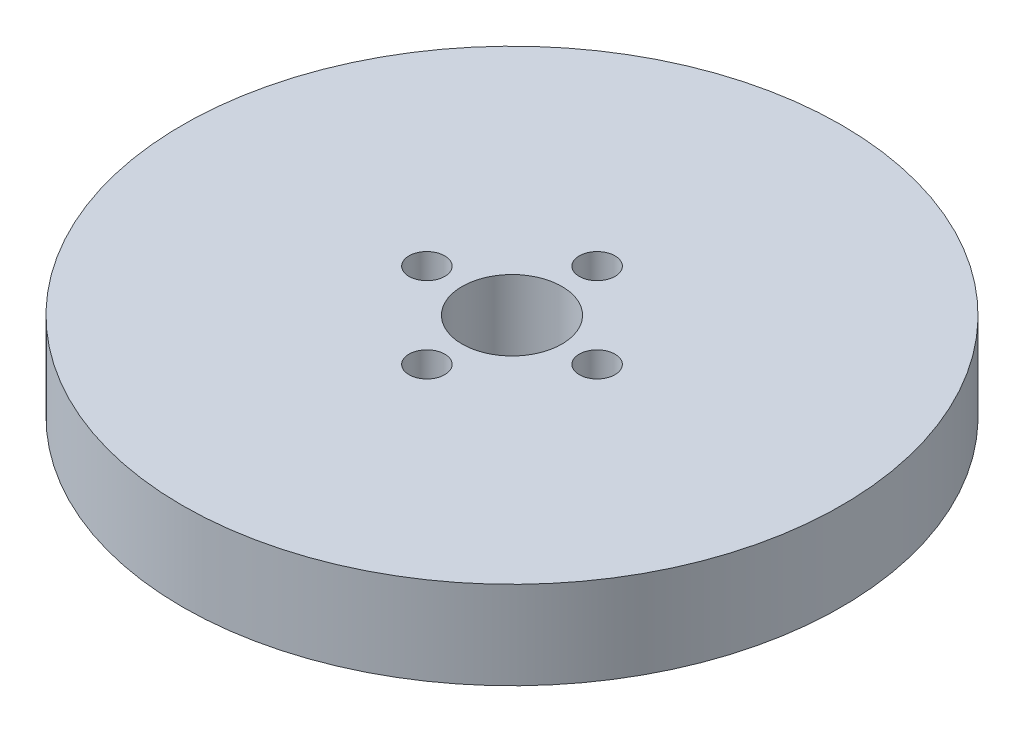
ISO-10303-21;
HEADER;
FILE_DESCRIPTION(('STEP AP214'),'2;1');
FILE_NAME('part.step','',(''),(''),'','','');
FILE_SCHEMA(('AUTOMOTIVE_DESIGN { 1 0 10303 214 1 1 1 1 }'));
ENDSEC;
DATA;
#1=APPLICATION_CONTEXT('core data for automotive mechanical design processes');
#2=APPLICATION_PROTOCOL_DEFINITION('international standard','automotive_design',2000,#1);
#3=PRODUCT_CONTEXT('',#1,'mechanical');
#4=PRODUCT('Part','Part','',(#3));
#5=PRODUCT_RELATED_PRODUCT_CATEGORY('part','',(#4));
#6=PRODUCT_DEFINITION_FORMATION('','',#4);
#7=PRODUCT_DEFINITION_CONTEXT('part definition',#1,'design');
#8=PRODUCT_DEFINITION('design','',#6,#7);
#9=PRODUCT_DEFINITION_SHAPE('','',#8);
#10=(LENGTH_UNIT() NAMED_UNIT(*) SI_UNIT(.MILLI.,.METRE.));
#11=(NAMED_UNIT(*) PLANE_ANGLE_UNIT() SI_UNIT($,.RADIAN.));
#12=(NAMED_UNIT(*) SI_UNIT($,.STERADIAN.) SOLID_ANGLE_UNIT());
#13=UNCERTAINTY_MEASURE_WITH_UNIT(LENGTH_MEASURE(1.E-05),#10,'distance_accuracy_value','');
#14=(GEOMETRIC_REPRESENTATION_CONTEXT(3) GLOBAL_UNCERTAINTY_ASSIGNED_CONTEXT((#13)) GLOBAL_UNIT_ASSIGNED_CONTEXT((#10,
#11,#12)) REPRESENTATION_CONTEXT('',''));
#15=CARTESIAN_POINT('',(0.,0.,0.));
#16=DIRECTION('',(0.,0.,1.));
#17=DIRECTION('',(1.,0.,0.));
#18=AXIS2_PLACEMENT_3D('',#15,#16,#17);
#19=CARTESIAN_POINT('',(0.,22.,0.));
#20=DIRECTION('',(0.,-1.,0.));
#21=DIRECTION('',(0.,0.,-1.));
#22=AXIS2_PLACEMENT_3D('',#19,#20,#21);
#23=CYLINDRICAL_SURFACE('',#22,82.5);
#24=CARTESIAN_POINT('',(0.,22.,0.));
#25=DIRECTION('',(0.,1.,0.));
#26=DIRECTION('',(0.,0.,1.));
#27=AXIS2_PLACEMENT_3D('',#24,#25,#26);
#28=CIRCLE('',#27,82.5);
#29=CARTESIAN_POINT('',(0.,22.,82.5));
#30=VERTEX_POINT('',#29);
#31=EDGE_CURVE('E10',#30,#30,#28,.T.);
#32=ORIENTED_EDGE('',*,*,#31,.F.);
#33=EDGE_LOOP('',(#32));
#34=FACE_BOUND('',#33,.T.);
#35=CARTESIAN_POINT('',(0.,0.,0.));
#36=DIRECTION('',(0.,1.,0.));
#37=DIRECTION('',(0.,0.,1.));
#38=AXIS2_PLACEMENT_3D('',#35,#36,#37);
#39=CIRCLE('',#38,82.5);
#40=CARTESIAN_POINT('',(0.,0.,82.5));
#41=VERTEX_POINT('',#40);
#42=EDGE_CURVE('E37',#41,#41,#39,.T.);
#43=ORIENTED_EDGE('',*,*,#42,.T.);
#44=EDGE_LOOP('',(#43));
#45=FACE_BOUND('',#44,.T.);
#46=ADVANCED_FACE('F40',(#34,#45),#23,.T.);
#47=CARTESIAN_POINT('',(0.,22.,0.));
#48=DIRECTION('',(0.,1.,0.));
#49=DIRECTION('',(0.,0.,1.));
#50=AXIS2_PLACEMENT_3D('',#47,#48,#49);
#51=PLANE('',#50);
#52=CARTESIAN_POINT('',(0.,22.,21.3070975802363));
#53=DIRECTION('',(0.,1.,0.));
#54=DIRECTION('',(1.,0.,0.));
#55=AXIS2_PLACEMENT_3D('',#52,#53,#54);
#56=CIRCLE('',#55,4.473192396797);
#57=CARTESIAN_POINT('',(0.,22.,25.7802899770333));
#58=VERTEX_POINT('',#57);
#59=EDGE_CURVE('E71',#58,#58,#56,.T.);
#60=ORIENTED_EDGE('',*,*,#59,.F.);
#61=EDGE_LOOP('',(#60));
#62=FACE_BOUND('',#61,.T.);
#63=CARTESIAN_POINT('',(21.3070975802363,22.,0.));
#64=DIRECTION('',(0.,1.,0.));
#65=DIRECTION('',(0.,0.,-1.));
#66=AXIS2_PLACEMENT_3D('',#63,#64,#65);
#67=CIRCLE('',#66,4.473192396797);
#68=CARTESIAN_POINT('',(21.3070975802363,22.,4.473192396797));
#69=VERTEX_POINT('',#68);
#70=EDGE_CURVE('E70',#69,#69,#67,.T.);
#71=ORIENTED_EDGE('',*,*,#70,.F.);
#72=EDGE_LOOP('',(#71));
#73=FACE_BOUND('',#72,.T.);
#74=CARTESIAN_POINT('',(-2.23180000758914E-13,22.,-21.3070975802363));
#75=DIRECTION('',(0.,1.,0.));
#76=DIRECTION('',(-1.,0.,0.));
#77=AXIS2_PLACEMENT_3D('',#74,#75,#76);
#78=CIRCLE('',#77,4.473192396797);
#79=CARTESIAN_POINT('',(-2.23180000758914E-13,22.,-16.8339051834393));
#80=VERTEX_POINT('',#79);
#81=EDGE_CURVE('E61',#80,#80,#78,.T.);
#82=ORIENTED_EDGE('',*,*,#81,.F.);
#83=EDGE_LOOP('',(#82));
#84=FACE_BOUND('',#83,.T.);
#85=CARTESIAN_POINT('',(-21.3070975802363,22.,0.));
#86=DIRECTION('',(0.,1.,0.));
#87=DIRECTION('',(0.,0.,1.));
#88=AXIS2_PLACEMENT_3D('',#85,#86,#87);
#89=CIRCLE('',#88,4.473192396797);
#90=CARTESIAN_POINT('',(-21.3070975802363,22.,4.473192396797));
#91=VERTEX_POINT('',#90);
#92=EDGE_CURVE('E54',#91,#91,#89,.T.);
#93=ORIENTED_EDGE('',*,*,#92,.F.);
#94=EDGE_LOOP('',(#93));
#95=FACE_BOUND('',#94,.T.);
#96=CARTESIAN_POINT('',(0.,22.,0.));
#97=DIRECTION('',(0.,1.,0.));
#98=DIRECTION('',(0.,0.,1.));
#99=AXIS2_PLACEMENT_3D('',#96,#97,#98);
#100=CIRCLE('',#99,12.5);
#101=CARTESIAN_POINT('',(0.,22.,12.5));
#102=VERTEX_POINT('',#101);
#103=EDGE_CURVE('E50',#102,#102,#100,.T.);
#104=ORIENTED_EDGE('',*,*,#103,.F.);
#105=EDGE_LOOP('',(#104));
#106=FACE_BOUND('',#105,.T.);
#107=ORIENTED_EDGE('',*,*,#31,.T.);
#108=EDGE_LOOP('',(#107));
#109=FACE_BOUND('',#108,.T.);
#110=ADVANCED_FACE('F86',(#62,#73,#84,#95,#106,#109),#51,.T.);
#111=CARTESIAN_POINT('',(0.,0.,0.));
#112=DIRECTION('',(0.,1.,0.));
#113=DIRECTION('',(0.,0.,1.));
#114=AXIS2_PLACEMENT_3D('',#111,#112,#113);
#115=PLANE('',#114);
#116=CARTESIAN_POINT('',(0.,0.,0.));
#117=DIRECTION('',(0.,1.,0.));
#118=DIRECTION('',(0.,0.,1.));
#119=AXIS2_PLACEMENT_3D('',#116,#117,#118);
#120=CIRCLE('',#119,12.5);
#121=CARTESIAN_POINT('',(0.,0.,12.5));
#122=VERTEX_POINT('',#121);
#123=EDGE_CURVE('E47',#122,#122,#120,.T.);
#124=ORIENTED_EDGE('',*,*,#123,.T.);
#125=EDGE_LOOP('',(#124));
#126=FACE_BOUND('',#125,.T.);
#127=ORIENTED_EDGE('',*,*,#42,.F.);
#128=EDGE_LOOP('',(#127));
#129=FACE_BOUND('',#128,.T.);
#130=ADVANCED_FACE('F93',(#126,#129),#115,.F.);
#131=CARTESIAN_POINT('',(0.,22.,0.));
#132=DIRECTION('',(0.,-1.,0.));
#133=DIRECTION('',(0.,0.,-1.));
#134=AXIS2_PLACEMENT_3D('',#131,#132,#133);
#135=CYLINDRICAL_SURFACE('',#134,12.5);
#136=ORIENTED_EDGE('',*,*,#103,.T.);
#137=EDGE_LOOP('',(#136));
#138=FACE_BOUND('',#137,.T.);
#139=ORIENTED_EDGE('',*,*,#123,.F.);
#140=EDGE_LOOP('',(#139));
#141=FACE_BOUND('',#140,.T.);
#142=ADVANCED_FACE('F101',(#138,#141),#135,.F.);
#143=CARTESIAN_POINT('',(-21.3070975802363,8.20057028025681,0.));
#144=DIRECTION('',(0.,1.,0.));
#145=DIRECTION('',(0.,0.,1.));
#146=AXIS2_PLACEMENT_3D('',#143,#144,#145);
#147=CYLINDRICAL_SURFACE('',#146,4.473192396797);
#148=CARTESIAN_POINT('',(-21.3070975802363,8.20057028025681,0.));
#149=DIRECTION('',(0.,1.,0.));
#150=DIRECTION('',(0.,0.,1.));
#151=AXIS2_PLACEMENT_3D('',#148,#149,#150);
#152=CIRCLE('',#151,4.473192396797);
#153=CARTESIAN_POINT('',(-21.3070975802363,8.20057028025681,4.473192396797));
#154=VERTEX_POINT('',#153);
#155=EDGE_CURVE('E55',#154,#154,#152,.T.);
#156=CARTESIAN_POINT('',(-21.3070975802363,8.20057028025681,4.473192396797));
#157=CARTESIAN_POINT('',(-21.3070975802363,8.34431433983746,4.473192396797));
#158=CARTESIAN_POINT('',(-21.3070975802363,8.48805839941812,4.473192396797));
#159=CARTESIAN_POINT('',(-21.3070975802363,8.77554651857944,4.473192396797));
#160=CARTESIAN_POINT('',(-21.3070975802363,8.9192905781601,4.473192396797));
#161=CARTESIAN_POINT('',(-21.3070975802363,9.20677869732141,4.473192396797));
#162=CARTESIAN_POINT('',(-21.3070975802363,9.35052275690207,4.473192396797));
#163=CARTESIAN_POINT('',(-21.3070975802363,9.63801087606338,4.473192396797));
#164=CARTESIAN_POINT('',(-21.3070975802363,9.78175493564405,4.473192396797));
#165=CARTESIAN_POINT('',(-21.3070975802363,10.0692430548054,4.473192396797));
#166=CARTESIAN_POINT('',(-21.3070975802363,10.212987114386,4.473192396797));
#167=CARTESIAN_POINT('',(-21.3070975802363,10.5004752335473,4.473192396797));
#168=CARTESIAN_POINT('',(-21.3070975802363,10.644219293128,4.473192396797));
#169=CARTESIAN_POINT('',(-21.3070975802363,10.9317074122893,4.473192396797));
#170=CARTESIAN_POINT('',(-21.3070975802363,11.07545147187,4.473192396797));
#171=CARTESIAN_POINT('',(-21.3070975802363,11.3629395910313,4.473192396797));
#172=CARTESIAN_POINT('',(-21.3070975802363,11.5066836506119,4.473192396797));
#173=CARTESIAN_POINT('',(-21.3070975802363,11.7941717697733,4.473192396797));
#174=CARTESIAN_POINT('',(-21.3070975802363,11.9379158293539,4.473192396797));
#175=CARTESIAN_POINT('',(-21.3070975802363,12.2254039485152,4.473192396797));
#176=CARTESIAN_POINT('',(-21.3070975802363,12.3691480080959,4.473192396797));
#177=CARTESIAN_POINT('',(-21.3070975802363,12.6566361272572,4.473192396797));
#178=CARTESIAN_POINT('',(-21.3070975802363,12.8003801868379,4.473192396797));
#179=CARTESIAN_POINT('',(-21.3070975802363,13.0878683059992,4.473192396797));
#180=CARTESIAN_POINT('',(-21.3070975802363,13.2316123655798,4.473192396797));
#181=CARTESIAN_POINT('',(-21.3070975802363,13.5191004847412,4.473192396797));
#182=CARTESIAN_POINT('',(-21.3070975802363,13.6628445443218,4.473192396797));
#183=CARTESIAN_POINT('',(-21.3070975802363,13.9503326634831,4.473192396797));
#184=CARTESIAN_POINT('',(-21.3070975802363,14.0940767230638,4.473192396797));
#185=CARTESIAN_POINT('',(-21.3070975802363,14.3815648422251,4.473192396797));
#186=CARTESIAN_POINT('',(-21.3070975802363,14.5253089018058,4.473192396797));
#187=CARTESIAN_POINT('',(-21.3070975802363,14.8127970209671,4.473192396797));
#188=CARTESIAN_POINT('',(-21.3070975802363,14.9565410805477,4.473192396797));
#189=CARTESIAN_POINT('',(-21.3070975802363,15.2440291997091,4.473192396797));
#190=CARTESIAN_POINT('',(-21.3070975802363,15.3877732592897,4.473192396797));
#191=CARTESIAN_POINT('',(-21.3070975802363,15.675261378451,4.473192396797));
#192=CARTESIAN_POINT('',(-21.3070975802363,15.8190054380317,4.473192396797));
#193=CARTESIAN_POINT('',(-21.3070975802363,16.106493557193,4.473192396797));
#194=CARTESIAN_POINT('',(-21.3070975802363,16.2502376167737,4.473192396797));
#195=CARTESIAN_POINT('',(-21.3070975802363,16.537725735935,4.473192396797));
#196=CARTESIAN_POINT('',(-21.3070975802363,16.6814697955156,4.473192396797));
#197=CARTESIAN_POINT('',(-21.3070975802363,16.968957914677,4.473192396797));
#198=CARTESIAN_POINT('',(-21.3070975802363,17.1127019742576,4.473192396797));
#199=CARTESIAN_POINT('',(-21.3070975802363,17.4001900934189,4.473192396797));
#200=CARTESIAN_POINT('',(-21.3070975802363,17.5439341529996,4.473192396797));
#201=CARTESIAN_POINT('',(-21.3070975802363,17.8314222721609,4.473192396797));
#202=CARTESIAN_POINT('',(-21.3070975802363,17.9751663317416,4.473192396797));
#203=CARTESIAN_POINT('',(-21.3070975802363,18.2626544509029,4.473192396797));
#204=CARTESIAN_POINT('',(-21.3070975802363,18.4063985104835,4.473192396797));
#205=CARTESIAN_POINT('',(-21.3070975802363,18.6938866296449,4.473192396797));
#206=CARTESIAN_POINT('',(-21.3070975802363,18.8376306892255,4.473192396797));
#207=CARTESIAN_POINT('',(-21.3070975802363,19.1251188083868,4.473192396797));
#208=CARTESIAN_POINT('',(-21.3070975802363,19.2688628679675,4.473192396797));
#209=CARTESIAN_POINT('',(-21.3070975802363,19.5563509871288,4.473192396797));
#210=CARTESIAN_POINT('',(-21.3070975802363,19.7000950467095,4.473192396797));
#211=CARTESIAN_POINT('',(-21.3070975802363,19.9875831658708,4.473192396797));
#212=CARTESIAN_POINT('',(-21.3070975802363,20.1313272254514,4.473192396797));
#213=CARTESIAN_POINT('',(-21.3070975802363,20.4188153446128,4.473192396797));
#214=CARTESIAN_POINT('',(-21.3070975802363,20.5625594041934,4.473192396797));
#215=CARTESIAN_POINT('',(-21.3070975802363,20.8500475233547,4.473192396797));
#216=CARTESIAN_POINT('',(-21.3070975802363,20.9937915829354,4.473192396797));
#217=CARTESIAN_POINT('',(-21.3070975802363,21.2812797020967,4.473192396797));
#218=CARTESIAN_POINT('',(-21.3070975802363,21.4250237616774,4.473192396797));
#219=CARTESIAN_POINT('',(-21.3070975802363,21.7125118808387,4.473192396797));
#220=CARTESIAN_POINT('',(-21.3070975802363,21.8562559404193,4.473192396797));
#221=CARTESIAN_POINT('',(-21.3070975802363,22.,4.473192396797));
#222=B_SPLINE_CURVE_WITH_KNOTS('',3,(#156,#157,#158,#159,#160,#161,#162,#163,#164,#165,#166,
#167,#168,#169,#170,#171,#172,#173,#174,#175,#176,#177,#178,#179,#180,#181,#182,#183,#184,#185,
#186,#187,#188,#189,#190,#191,#192,#193,#194,#195,#196,#197,#198,#199,#200,#201,#202,#203,#204,
#205,#206,#207,#208,#209,#210,#211,#212,#213,#214,#215,#216,#217,#218,#219,#220,#221),
.UNSPECIFIED.,.F.,.F.,(4,2,2,2,2,2,2,2,2,2,2,2,2,2,2,2,2,2,2,2,2,2,2,2,2,2,2,2,2,2,2,2,4),(0.,
0.431232178741975,0.862464357483949,1.29369653622592,1.7249287149679,2.15616089370987,
2.58739307245185,3.01862525119382,3.4498574299358,3.88108960867777,4.31232178741975,
4.74355396616172,5.1747861449037,5.60601832364567,6.03725050238765,6.46848268112962,
6.8997148598716,7.33094703861357,7.76217921735554,8.19341139609752,8.62464357483949,
9.05587575358147,9.48710793232345,9.91834011106542,10.3495722898074,10.7808044685494,
11.2120366472913,11.6432688260333,12.0745010047753,12.5057331835173,12.9369653622592,
13.3681975410012,13.7994297197432),.UNSPECIFIED.);
#223=EDGE_CURVE('BSEAM102',#154,#91,#222,.T.);
#224=ORIENTED_EDGE('',*,*,#155,.F.);
#225=ORIENTED_EDGE('',*,*,#92,.T.);
#226=ORIENTED_EDGE('',*,*,#223,.T.);
#227=ORIENTED_EDGE('',*,*,#223,.F.);
#228=EDGE_LOOP('',(#224,#226,#225,#227));
#229=FACE_BOUND('',#228,.T.);
#230=ADVANCED_FACE('F102',(#229),#147,.F.);
#231=CARTESIAN_POINT('',(-21.3070975802363,8.20057028025681,0.));
#232=DIRECTION('',(0.,1.,0.));
#233=DIRECTION('',(0.,0.,1.));
#234=AXIS2_PLACEMENT_3D('',#231,#232,#233);
#235=PLANE('',#234);
#236=ORIENTED_EDGE('',*,*,#155,.T.);
#237=EDGE_LOOP('',(#236));
#238=FACE_BOUND('',#237,.T.);
#239=ADVANCED_FACE('F133',(#238),#235,.T.);
#240=CARTESIAN_POINT('',(-2.23180000758914E-13,8.20057028025681,-21.3070975802363));
#241=DIRECTION('',(0.,1.,0.));
#242=DIRECTION('',(0.,0.,1.));
#243=AXIS2_PLACEMENT_3D('',#240,#241,#242);
#244=CYLINDRICAL_SURFACE('',#243,4.473192396797);
#245=CARTESIAN_POINT('',(-2.23180000758914E-13,8.20057028025681,-21.3070975802363));
#246=DIRECTION('',(0.,1.,0.));
#247=DIRECTION('',(-1.,0.,0.));
#248=AXIS2_PLACEMENT_3D('',#245,#246,#247);
#249=CIRCLE('',#248,4.473192396797);
#250=CARTESIAN_POINT('',(-2.23180000758914E-13,8.20057028025681,-16.8339051834393));
#251=VERTEX_POINT('',#250);
#252=EDGE_CURVE('E63',#251,#251,#249,.T.);
#253=CARTESIAN_POINT('',(-2.23180000758914E-13,8.20057028025681,-16.8339051834393));
#254=CARTESIAN_POINT('',(-2.23180000758914E-13,8.34431433983746,-16.8339051834393));
#255=CARTESIAN_POINT('',(-2.23180000758914E-13,8.48805839941812,-16.8339051834393));
#256=CARTESIAN_POINT('',(-2.23180000758914E-13,8.77554651857944,-16.8339051834393));
#257=CARTESIAN_POINT('',(-2.23180000758914E-13,8.9192905781601,-16.8339051834393));
#258=CARTESIAN_POINT('',(-2.23180000758914E-13,9.20677869732141,-16.8339051834393));
#259=CARTESIAN_POINT('',(-2.23180000758914E-13,9.35052275690207,-16.8339051834393));
#260=CARTESIAN_POINT('',(-2.23180000758914E-13,9.63801087606338,-16.8339051834393));
#261=CARTESIAN_POINT('',(-2.23180000758914E-13,9.78175493564405,-16.8339051834393));
#262=CARTESIAN_POINT('',(-2.23180000758914E-13,10.0692430548054,-16.8339051834393));
#263=CARTESIAN_POINT('',(-2.23180000758914E-13,10.212987114386,-16.8339051834393));
#264=CARTESIAN_POINT('',(-2.23180000758914E-13,10.5004752335473,-16.8339051834393));
#265=CARTESIAN_POINT('',(-2.23180000758914E-13,10.644219293128,-16.8339051834393));
#266=CARTESIAN_POINT('',(-2.23180000758914E-13,10.9317074122893,-16.8339051834393));
#267=CARTESIAN_POINT('',(-2.23180000758914E-13,11.07545147187,-16.8339051834393));
#268=CARTESIAN_POINT('',(-2.23180000758914E-13,11.3629395910313,-16.8339051834393));
#269=CARTESIAN_POINT('',(-2.23180000758914E-13,11.5066836506119,-16.8339051834393));
#270=CARTESIAN_POINT('',(-2.23180000758914E-13,11.7941717697733,-16.8339051834393));
#271=CARTESIAN_POINT('',(-2.23180000758914E-13,11.9379158293539,-16.8339051834393));
#272=CARTESIAN_POINT('',(-2.23180000758914E-13,12.2254039485152,-16.8339051834393));
#273=CARTESIAN_POINT('',(-2.23180000758914E-13,12.3691480080959,-16.8339051834393));
#274=CARTESIAN_POINT('',(-2.23180000758914E-13,12.6566361272572,-16.8339051834393));
#275=CARTESIAN_POINT('',(-2.23180000758914E-13,12.8003801868379,-16.8339051834393));
#276=CARTESIAN_POINT('',(-2.23180000758914E-13,13.0878683059992,-16.8339051834393));
#277=CARTESIAN_POINT('',(-2.23180000758914E-13,13.2316123655798,-16.8339051834393));
#278=CARTESIAN_POINT('',(-2.23180000758914E-13,13.5191004847412,-16.8339051834393));
#279=CARTESIAN_POINT('',(-2.23180000758914E-13,13.6628445443218,-16.8339051834393));
#280=CARTESIAN_POINT('',(-2.23180000758914E-13,13.9503326634831,-16.8339051834393));
#281=CARTESIAN_POINT('',(-2.23180000758914E-13,14.0940767230638,-16.8339051834393));
#282=CARTESIAN_POINT('',(-2.23180000758914E-13,14.3815648422251,-16.8339051834393));
#283=CARTESIAN_POINT('',(-2.23180000758914E-13,14.5253089018058,-16.8339051834393));
#284=CARTESIAN_POINT('',(-2.23180000758914E-13,14.8127970209671,-16.8339051834393));
#285=CARTESIAN_POINT('',(-2.23180000758914E-13,14.9565410805477,-16.8339051834393));
#286=CARTESIAN_POINT('',(-2.23180000758914E-13,15.2440291997091,-16.8339051834393));
#287=CARTESIAN_POINT('',(-2.23180000758914E-13,15.3877732592897,-16.8339051834393));
#288=CARTESIAN_POINT('',(-2.23180000758914E-13,15.675261378451,-16.8339051834393));
#289=CARTESIAN_POINT('',(-2.23180000758914E-13,15.8190054380317,-16.8339051834393));
#290=CARTESIAN_POINT('',(-2.23180000758914E-13,16.106493557193,-16.8339051834393));
#291=CARTESIAN_POINT('',(-2.23180000758914E-13,16.2502376167737,-16.8339051834393));
#292=CARTESIAN_POINT('',(-2.23180000758914E-13,16.537725735935,-16.8339051834393));
#293=CARTESIAN_POINT('',(-2.23180000758914E-13,16.6814697955156,-16.8339051834393));
#294=CARTESIAN_POINT('',(-2.23180000758914E-13,16.968957914677,-16.8339051834393));
#295=CARTESIAN_POINT('',(-2.23180000758914E-13,17.1127019742576,-16.8339051834393));
#296=CARTESIAN_POINT('',(-2.23180000758914E-13,17.4001900934189,-16.8339051834393));
#297=CARTESIAN_POINT('',(-2.23180000758914E-13,17.5439341529996,-16.8339051834393));
#298=CARTESIAN_POINT('',(-2.23180000758914E-13,17.8314222721609,-16.8339051834393));
#299=CARTESIAN_POINT('',(-2.23180000758914E-13,17.9751663317416,-16.8339051834393));
#300=CARTESIAN_POINT('',(-2.23180000758914E-13,18.2626544509029,-16.8339051834393));
#301=CARTESIAN_POINT('',(-2.23180000758914E-13,18.4063985104835,-16.8339051834393));
#302=CARTESIAN_POINT('',(-2.23180000758914E-13,18.6938866296449,-16.8339051834393));
#303=CARTESIAN_POINT('',(-2.23180000758914E-13,18.8376306892255,-16.8339051834393));
#304=CARTESIAN_POINT('',(-2.23180000758914E-13,19.1251188083868,-16.8339051834393));
#305=CARTESIAN_POINT('',(-2.23180000758914E-13,19.2688628679675,-16.8339051834393));
#306=CARTESIAN_POINT('',(-2.23180000758914E-13,19.5563509871288,-16.8339051834393));
#307=CARTESIAN_POINT('',(-2.23180000758914E-13,19.7000950467095,-16.8339051834393));
#308=CARTESIAN_POINT('',(-2.23180000758914E-13,19.9875831658708,-16.8339051834393));
#309=CARTESIAN_POINT('',(-2.23180000758914E-13,20.1313272254514,-16.8339051834393));
#310=CARTESIAN_POINT('',(-2.23180000758914E-13,20.4188153446128,-16.8339051834393));
#311=CARTESIAN_POINT('',(-2.23180000758914E-13,20.5625594041934,-16.8339051834393));
#312=CARTESIAN_POINT('',(-2.23180000758914E-13,20.8500475233547,-16.8339051834393));
#313=CARTESIAN_POINT('',(-2.23180000758914E-13,20.9937915829354,-16.8339051834393));
#314=CARTESIAN_POINT('',(-2.23180000758914E-13,21.2812797020967,-16.8339051834393));
#315=CARTESIAN_POINT('',(-2.23180000758914E-13,21.4250237616774,-16.8339051834393));
#316=CARTESIAN_POINT('',(-2.23180000758914E-13,21.7125118808387,-16.8339051834393));
#317=CARTESIAN_POINT('',(-2.23180000758914E-13,21.8562559404193,-16.8339051834393));
#318=CARTESIAN_POINT('',(-2.23180000758914E-13,22.,-16.8339051834393));
#319=B_SPLINE_CURVE_WITH_KNOTS('',3,(#253,#254,#255,#256,#257,#258,#259,#260,#261,#262,#263,
#264,#265,#266,#267,#268,#269,#270,#271,#272,#273,#274,#275,#276,#277,#278,#279,#280,#281,#282,
#283,#284,#285,#286,#287,#288,#289,#290,#291,#292,#293,#294,#295,#296,#297,#298,#299,#300,#301,
#302,#303,#304,#305,#306,#307,#308,#309,#310,#311,#312,#313,#314,#315,#316,#317,#318),
.UNSPECIFIED.,.F.,.F.,(4,2,2,2,2,2,2,2,2,2,2,2,2,2,2,2,2,2,2,2,2,2,2,2,2,2,2,2,2,2,2,2,4),(0.,
0.431232178741975,0.862464357483949,1.29369653622592,1.7249287149679,2.15616089370987,
2.58739307245185,3.01862525119382,3.4498574299358,3.88108960867777,4.31232178741975,
4.74355396616172,5.1747861449037,5.60601832364567,6.03725050238765,6.46848268112962,
6.8997148598716,7.33094703861357,7.76217921735554,8.19341139609752,8.62464357483949,
9.05587575358147,9.48710793232345,9.91834011106542,10.3495722898074,10.7808044685494,
11.2120366472913,11.6432688260333,12.0745010047753,12.5057331835173,12.9369653622592,
13.3681975410012,13.7994297197432),.UNSPECIFIED.);
#320=EDGE_CURVE('BSEAM142',#251,#80,#319,.T.);
#321=ORIENTED_EDGE('',*,*,#252,.F.);
#322=ORIENTED_EDGE('',*,*,#81,.T.);
#323=ORIENTED_EDGE('',*,*,#320,.T.);
#324=ORIENTED_EDGE('',*,*,#320,.F.);
#325=EDGE_LOOP('',(#321,#323,#322,#324));
#326=FACE_BOUND('',#325,.T.);
#327=ADVANCED_FACE('F142',(#326),#244,.F.);
#328=CARTESIAN_POINT('',(-2.23180000758914E-13,8.20057028025681,-21.3070975802363));
#329=DIRECTION('',(0.,1.,0.));
#330=DIRECTION('',(-1.,0.,0.));
#331=AXIS2_PLACEMENT_3D('',#328,#329,#330);
#332=PLANE('',#331);
#333=ORIENTED_EDGE('',*,*,#252,.T.);
#334=EDGE_LOOP('',(#333));
#335=FACE_BOUND('',#334,.T.);
#336=ADVANCED_FACE('F156',(#335),#332,.T.);
#337=CARTESIAN_POINT('',(21.3070975802363,8.20057028025681,0.));
#338=DIRECTION('',(0.,1.,0.));
#339=DIRECTION('',(0.,0.,1.));
#340=AXIS2_PLACEMENT_3D('',#337,#338,#339);
#341=CYLINDRICAL_SURFACE('',#340,4.473192396797);
#342=CARTESIAN_POINT('',(21.3070975802363,8.20057028025681,0.));
#343=DIRECTION('',(0.,1.,0.));
#344=DIRECTION('',(0.,0.,-1.));
#345=AXIS2_PLACEMENT_3D('',#342,#343,#344);
#346=CIRCLE('',#345,4.473192396797);
#347=CARTESIAN_POINT('',(21.3070975802363,8.20057028025681,4.473192396797));
#348=VERTEX_POINT('',#347);
#349=EDGE_CURVE('E69',#348,#348,#346,.T.);
#350=CARTESIAN_POINT('',(21.3070975802363,8.20057028025681,4.473192396797));
#351=CARTESIAN_POINT('',(21.3070975802363,8.34431433983746,4.473192396797));
#352=CARTESIAN_POINT('',(21.3070975802363,8.48805839941812,4.473192396797));
#353=CARTESIAN_POINT('',(21.3070975802363,8.77554651857944,4.473192396797));
#354=CARTESIAN_POINT('',(21.3070975802363,8.9192905781601,4.473192396797));
#355=CARTESIAN_POINT('',(21.3070975802363,9.20677869732141,4.473192396797));
#356=CARTESIAN_POINT('',(21.3070975802363,9.35052275690207,4.473192396797));
#357=CARTESIAN_POINT('',(21.3070975802363,9.63801087606338,4.473192396797));
#358=CARTESIAN_POINT('',(21.3070975802363,9.78175493564405,4.473192396797));
#359=CARTESIAN_POINT('',(21.3070975802363,10.0692430548054,4.473192396797));
#360=CARTESIAN_POINT('',(21.3070975802363,10.212987114386,4.473192396797));
#361=CARTESIAN_POINT('',(21.3070975802363,10.5004752335473,4.473192396797));
#362=CARTESIAN_POINT('',(21.3070975802363,10.644219293128,4.473192396797));
#363=CARTESIAN_POINT('',(21.3070975802363,10.9317074122893,4.473192396797));
#364=CARTESIAN_POINT('',(21.3070975802363,11.07545147187,4.473192396797));
#365=CARTESIAN_POINT('',(21.3070975802363,11.3629395910313,4.473192396797));
#366=CARTESIAN_POINT('',(21.3070975802363,11.5066836506119,4.473192396797));
#367=CARTESIAN_POINT('',(21.3070975802363,11.7941717697733,4.473192396797));
#368=CARTESIAN_POINT('',(21.3070975802363,11.9379158293539,4.473192396797));
#369=CARTESIAN_POINT('',(21.3070975802363,12.2254039485152,4.473192396797));
#370=CARTESIAN_POINT('',(21.3070975802363,12.3691480080959,4.473192396797));
#371=CARTESIAN_POINT('',(21.3070975802363,12.6566361272572,4.473192396797));
#372=CARTESIAN_POINT('',(21.3070975802363,12.8003801868379,4.473192396797));
#373=CARTESIAN_POINT('',(21.3070975802363,13.0878683059992,4.473192396797));
#374=CARTESIAN_POINT('',(21.3070975802363,13.2316123655798,4.473192396797));
#375=CARTESIAN_POINT('',(21.3070975802363,13.5191004847412,4.473192396797));
#376=CARTESIAN_POINT('',(21.3070975802363,13.6628445443218,4.473192396797));
#377=CARTESIAN_POINT('',(21.3070975802363,13.9503326634831,4.473192396797));
#378=CARTESIAN_POINT('',(21.3070975802363,14.0940767230638,4.473192396797));
#379=CARTESIAN_POINT('',(21.3070975802363,14.3815648422251,4.473192396797));
#380=CARTESIAN_POINT('',(21.3070975802363,14.5253089018058,4.473192396797));
#381=CARTESIAN_POINT('',(21.3070975802363,14.8127970209671,4.473192396797));
#382=CARTESIAN_POINT('',(21.3070975802363,14.9565410805477,4.473192396797));
#383=CARTESIAN_POINT('',(21.3070975802363,15.2440291997091,4.473192396797));
#384=CARTESIAN_POINT('',(21.3070975802363,15.3877732592897,4.473192396797));
#385=CARTESIAN_POINT('',(21.3070975802363,15.675261378451,4.473192396797));
#386=CARTESIAN_POINT('',(21.3070975802363,15.8190054380317,4.473192396797));
#387=CARTESIAN_POINT('',(21.3070975802363,16.106493557193,4.473192396797));
#388=CARTESIAN_POINT('',(21.3070975802363,16.2502376167737,4.473192396797));
#389=CARTESIAN_POINT('',(21.3070975802363,16.537725735935,4.473192396797));
#390=CARTESIAN_POINT('',(21.3070975802363,16.6814697955156,4.473192396797));
#391=CARTESIAN_POINT('',(21.3070975802363,16.968957914677,4.473192396797));
#392=CARTESIAN_POINT('',(21.3070975802363,17.1127019742576,4.473192396797));
#393=CARTESIAN_POINT('',(21.3070975802363,17.4001900934189,4.473192396797));
#394=CARTESIAN_POINT('',(21.3070975802363,17.5439341529996,4.473192396797));
#395=CARTESIAN_POINT('',(21.3070975802363,17.8314222721609,4.473192396797));
#396=CARTESIAN_POINT('',(21.3070975802363,17.9751663317416,4.473192396797));
#397=CARTESIAN_POINT('',(21.3070975802363,18.2626544509029,4.473192396797));
#398=CARTESIAN_POINT('',(21.3070975802363,18.4063985104835,4.473192396797));
#399=CARTESIAN_POINT('',(21.3070975802363,18.6938866296449,4.473192396797));
#400=CARTESIAN_POINT('',(21.3070975802363,18.8376306892255,4.473192396797));
#401=CARTESIAN_POINT('',(21.3070975802363,19.1251188083868,4.473192396797));
#402=CARTESIAN_POINT('',(21.3070975802363,19.2688628679675,4.473192396797));
#403=CARTESIAN_POINT('',(21.3070975802363,19.5563509871288,4.473192396797));
#404=CARTESIAN_POINT('',(21.3070975802363,19.7000950467095,4.473192396797));
#405=CARTESIAN_POINT('',(21.3070975802363,19.9875831658708,4.473192396797));
#406=CARTESIAN_POINT('',(21.3070975802363,20.1313272254514,4.473192396797));
#407=CARTESIAN_POINT('',(21.3070975802363,20.4188153446128,4.473192396797));
#408=CARTESIAN_POINT('',(21.3070975802363,20.5625594041934,4.473192396797));
#409=CARTESIAN_POINT('',(21.3070975802363,20.8500475233547,4.473192396797));
#410=CARTESIAN_POINT('',(21.3070975802363,20.9937915829354,4.473192396797));
#411=CARTESIAN_POINT('',(21.3070975802363,21.2812797020967,4.473192396797));
#412=CARTESIAN_POINT('',(21.3070975802363,21.4250237616774,4.473192396797));
#413=CARTESIAN_POINT('',(21.3070975802363,21.7125118808387,4.473192396797));
#414=CARTESIAN_POINT('',(21.3070975802363,21.8562559404193,4.473192396797));
#415=CARTESIAN_POINT('',(21.3070975802363,22.,4.473192396797));
#416=B_SPLINE_CURVE_WITH_KNOTS('',3,(#350,#351,#352,#353,#354,#355,#356,#357,#358,#359,#360,
#361,#362,#363,#364,#365,#366,#367,#368,#369,#370,#371,#372,#373,#374,#375,#376,#377,#378,#379,
#380,#381,#382,#383,#384,#385,#386,#387,#388,#389,#390,#391,#392,#393,#394,#395,#396,#397,#398,
#399,#400,#401,#402,#403,#404,#405,#406,#407,#408,#409,#410,#411,#412,#413,#414,#415),
.UNSPECIFIED.,.F.,.F.,(4,2,2,2,2,2,2,2,2,2,2,2,2,2,2,2,2,2,2,2,2,2,2,2,2,2,2,2,2,2,2,2,4),(0.,
0.431232178741975,0.862464357483949,1.29369653622592,1.7249287149679,2.15616089370987,
2.58739307245185,3.01862525119382,3.4498574299358,3.88108960867777,4.31232178741975,
4.74355396616172,5.1747861449037,5.60601832364567,6.03725050238765,6.46848268112962,
6.8997148598716,7.33094703861357,7.76217921735554,8.19341139609752,8.62464357483949,
9.05587575358147,9.48710793232345,9.91834011106542,10.3495722898074,10.7808044685494,
11.2120366472913,11.6432688260333,12.0745010047753,12.5057331835173,12.9369653622592,
13.3681975410012,13.7994297197432),.UNSPECIFIED.);
#417=EDGE_CURVE('BSEAM164',#348,#69,#416,.T.);
#418=ORIENTED_EDGE('',*,*,#349,.F.);
#419=ORIENTED_EDGE('',*,*,#70,.T.);
#420=ORIENTED_EDGE('',*,*,#417,.T.);
#421=ORIENTED_EDGE('',*,*,#417,.F.);
#422=EDGE_LOOP('',(#418,#420,#419,#421));
#423=FACE_BOUND('',#422,.T.);
#424=ADVANCED_FACE('F164',(#423),#341,.F.);
#425=CARTESIAN_POINT('',(21.3070975802363,8.20057028025681,0.));
#426=DIRECTION('',(0.,1.,0.));
#427=DIRECTION('',(0.,0.,-1.));
#428=AXIS2_PLACEMENT_3D('',#425,#426,#427);
#429=PLANE('',#428);
#430=ORIENTED_EDGE('',*,*,#349,.T.);
#431=EDGE_LOOP('',(#430));
#432=FACE_BOUND('',#431,.T.);
#433=ADVANCED_FACE('F83',(#432),#429,.T.);
#434=CARTESIAN_POINT('',(0.,8.20057028025681,21.3070975802363));
#435=DIRECTION('',(0.,1.,0.));
#436=DIRECTION('',(0.,0.,1.));
#437=AXIS2_PLACEMENT_3D('',#434,#435,#436);
#438=CYLINDRICAL_SURFACE('',#437,4.473192396797);
#439=CARTESIAN_POINT('',(0.,8.20057028025681,21.3070975802363));
#440=DIRECTION('',(0.,1.,0.));
#441=DIRECTION('',(1.,0.,0.));
#442=AXIS2_PLACEMENT_3D('',#439,#440,#441);
#443=CIRCLE('',#442,4.473192396797);
#444=CARTESIAN_POINT('',(0.,8.20057028025681,25.7802899770333));
#445=VERTEX_POINT('',#444);
#446=EDGE_CURVE('E59',#445,#445,#443,.T.);
#447=CARTESIAN_POINT('',(0.,8.20057028025681,25.7802899770333));
#448=CARTESIAN_POINT('',(0.,8.34431433983746,25.7802899770333));
#449=CARTESIAN_POINT('',(0.,8.48805839941812,25.7802899770333));
#450=CARTESIAN_POINT('',(0.,8.77554651857944,25.7802899770333));
#451=CARTESIAN_POINT('',(0.,8.9192905781601,25.7802899770333));
#452=CARTESIAN_POINT('',(0.,9.20677869732141,25.7802899770333));
#453=CARTESIAN_POINT('',(0.,9.35052275690207,25.7802899770333));
#454=CARTESIAN_POINT('',(0.,9.63801087606338,25.7802899770333));
#455=CARTESIAN_POINT('',(0.,9.78175493564405,25.7802899770333));
#456=CARTESIAN_POINT('',(0.,10.0692430548054,25.7802899770333));
#457=CARTESIAN_POINT('',(0.,10.212987114386,25.7802899770333));
#458=CARTESIAN_POINT('',(0.,10.5004752335473,25.7802899770333));
#459=CARTESIAN_POINT('',(0.,10.644219293128,25.7802899770333));
#460=CARTESIAN_POINT('',(0.,10.9317074122893,25.7802899770333));
#461=CARTESIAN_POINT('',(0.,11.07545147187,25.7802899770333));
#462=CARTESIAN_POINT('',(0.,11.3629395910313,25.7802899770333));
#463=CARTESIAN_POINT('',(0.,11.5066836506119,25.7802899770333));
#464=CARTESIAN_POINT('',(0.,11.7941717697733,25.7802899770333));
#465=CARTESIAN_POINT('',(0.,11.9379158293539,25.7802899770333));
#466=CARTESIAN_POINT('',(0.,12.2254039485152,25.7802899770333));
#467=CARTESIAN_POINT('',(0.,12.3691480080959,25.7802899770333));
#468=CARTESIAN_POINT('',(0.,12.6566361272572,25.7802899770333));
#469=CARTESIAN_POINT('',(0.,12.8003801868379,25.7802899770333));
#470=CARTESIAN_POINT('',(0.,13.0878683059992,25.7802899770333));
#471=CARTESIAN_POINT('',(0.,13.2316123655798,25.7802899770333));
#472=CARTESIAN_POINT('',(0.,13.5191004847412,25.7802899770333));
#473=CARTESIAN_POINT('',(0.,13.6628445443218,25.7802899770333));
#474=CARTESIAN_POINT('',(0.,13.9503326634831,25.7802899770333));
#475=CARTESIAN_POINT('',(0.,14.0940767230638,25.7802899770333));
#476=CARTESIAN_POINT('',(0.,14.3815648422251,25.7802899770333));
#477=CARTESIAN_POINT('',(0.,14.5253089018058,25.7802899770333));
#478=CARTESIAN_POINT('',(0.,14.8127970209671,25.7802899770333));
#479=CARTESIAN_POINT('',(0.,14.9565410805477,25.7802899770333));
#480=CARTESIAN_POINT('',(0.,15.2440291997091,25.7802899770333));
#481=CARTESIAN_POINT('',(0.,15.3877732592897,25.7802899770333));
#482=CARTESIAN_POINT('',(0.,15.675261378451,25.7802899770333));
#483=CARTESIAN_POINT('',(0.,15.8190054380317,25.7802899770333));
#484=CARTESIAN_POINT('',(0.,16.106493557193,25.7802899770333));
#485=CARTESIAN_POINT('',(0.,16.2502376167737,25.7802899770333));
#486=CARTESIAN_POINT('',(0.,16.537725735935,25.7802899770333));
#487=CARTESIAN_POINT('',(0.,16.6814697955156,25.7802899770333));
#488=CARTESIAN_POINT('',(0.,16.968957914677,25.7802899770333));
#489=CARTESIAN_POINT('',(0.,17.1127019742576,25.7802899770333));
#490=CARTESIAN_POINT('',(0.,17.4001900934189,25.7802899770333));
#491=CARTESIAN_POINT('',(0.,17.5439341529996,25.7802899770333));
#492=CARTESIAN_POINT('',(0.,17.8314222721609,25.7802899770333));
#493=CARTESIAN_POINT('',(0.,17.9751663317416,25.7802899770333));
#494=CARTESIAN_POINT('',(0.,18.2626544509029,25.7802899770333));
#495=CARTESIAN_POINT('',(0.,18.4063985104835,25.7802899770333));
#496=CARTESIAN_POINT('',(0.,18.6938866296449,25.7802899770333));
#497=CARTESIAN_POINT('',(0.,18.8376306892255,25.7802899770333));
#498=CARTESIAN_POINT('',(0.,19.1251188083868,25.7802899770333));
#499=CARTESIAN_POINT('',(0.,19.2688628679675,25.7802899770333));
#500=CARTESIAN_POINT('',(0.,19.5563509871288,25.7802899770333));
#501=CARTESIAN_POINT('',(0.,19.7000950467095,25.7802899770333));
#502=CARTESIAN_POINT('',(0.,19.9875831658708,25.7802899770333));
#503=CARTESIAN_POINT('',(0.,20.1313272254514,25.7802899770333));
#504=CARTESIAN_POINT('',(0.,20.4188153446128,25.7802899770333));
#505=CARTESIAN_POINT('',(0.,20.5625594041934,25.7802899770333));
#506=CARTESIAN_POINT('',(0.,20.8500475233547,25.7802899770333));
#507=CARTESIAN_POINT('',(0.,20.9937915829354,25.7802899770333));
#508=CARTESIAN_POINT('',(0.,21.2812797020967,25.7802899770333));
#509=CARTESIAN_POINT('',(0.,21.4250237616774,25.7802899770333));
#510=CARTESIAN_POINT('',(0.,21.7125118808387,25.7802899770333));
#511=CARTESIAN_POINT('',(0.,21.8562559404193,25.7802899770333));
#512=CARTESIAN_POINT('',(0.,22.,25.7802899770333));
#513=B_SPLINE_CURVE_WITH_KNOTS('',3,(#447,#448,#449,#450,#451,#452,#453,#454,#455,#456,#457,
#458,#459,#460,#461,#462,#463,#464,#465,#466,#467,#468,#469,#470,#471,#472,#473,#474,#475,#476,
#477,#478,#479,#480,#481,#482,#483,#484,#485,#486,#487,#488,#489,#490,#491,#492,#493,#494,#495,
#496,#497,#498,#499,#500,#501,#502,#503,#504,#505,#506,#507,#508,#509,#510,#511,#512),
.UNSPECIFIED.,.F.,.F.,(4,2,2,2,2,2,2,2,2,2,2,2,2,2,2,2,2,2,2,2,2,2,2,2,2,2,2,2,2,2,2,2,4),(0.,
0.431232178741975,0.862464357483949,1.29369653622592,1.7249287149679,2.15616089370987,
2.58739307245185,3.01862525119382,3.4498574299358,3.88108960867777,4.31232178741975,
4.74355396616172,5.1747861449037,5.60601832364567,6.03725050238765,6.46848268112962,
6.8997148598716,7.33094703861357,7.76217921735554,8.19341139609752,8.62464357483949,
9.05587575358147,9.48710793232345,9.91834011106542,10.3495722898074,10.7808044685494,
11.2120366472913,11.6432688260333,12.0745010047753,12.5057331835173,12.9369653622592,
13.3681975410012,13.7994297197432),.UNSPECIFIED.);
#514=EDGE_CURVE('BSEAM81',#445,#58,#513,.T.);
#515=ORIENTED_EDGE('',*,*,#446,.F.);
#516=ORIENTED_EDGE('',*,*,#59,.T.);
#517=ORIENTED_EDGE('',*,*,#514,.T.);
#518=ORIENTED_EDGE('',*,*,#514,.F.);
#519=EDGE_LOOP('',(#515,#517,#516,#518));
#520=FACE_BOUND('',#519,.T.);
#521=ADVANCED_FACE('F81',(#520),#438,.F.);
#522=CARTESIAN_POINT('',(0.,8.20057028025681,21.3070975802363));
#523=DIRECTION('',(0.,1.,0.));
#524=DIRECTION('',(1.,0.,0.));
#525=AXIS2_PLACEMENT_3D('',#522,#523,#524);
#526=PLANE('',#525);
#527=ORIENTED_EDGE('',*,*,#446,.T.);
#528=EDGE_LOOP('',(#527));
#529=FACE_BOUND('',#528,.T.);
#530=ADVANCED_FACE('F78',(#529),#526,.T.);
#531=CLOSED_SHELL('',(#46,#110,#130,#142,#230,#239,#327,#336,#424,#433,#521,#530));
#532=MANIFOLD_SOLID_BREP('B2',#531);
#533=ADVANCED_BREP_SHAPE_REPRESENTATION('',(#18,#532),#14);
#534=SHAPE_DEFINITION_REPRESENTATION(#9,#533);
ENDSEC;
END-ISO-10303-21;
